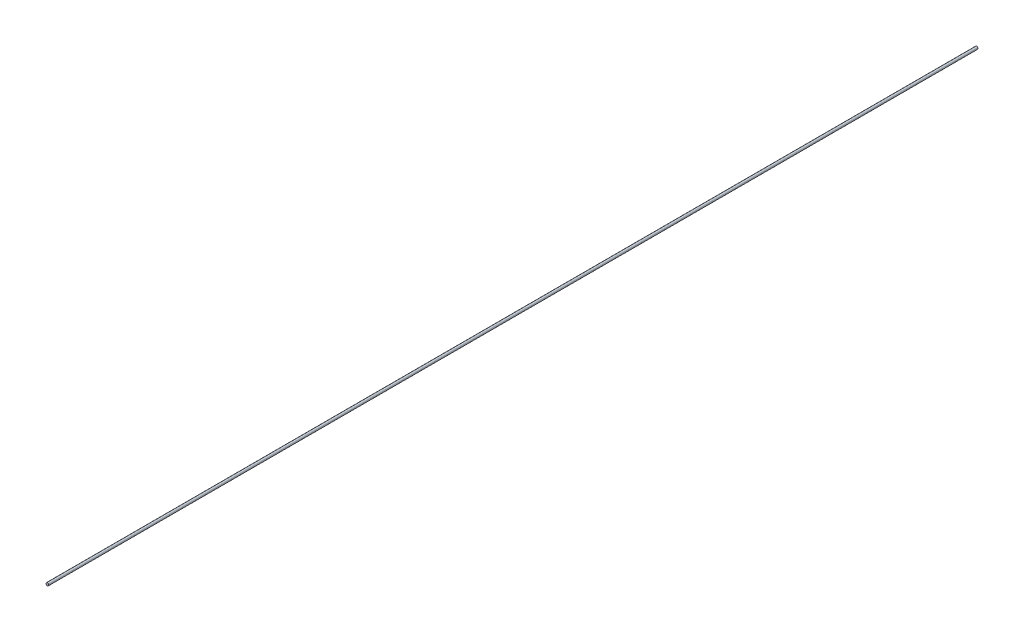
ISO-10303-21;
HEADER;
FILE_DESCRIPTION(('STEP AP214'),'2;1');
FILE_NAME('part.step','',(''),(''),'','','');
FILE_SCHEMA(('AUTOMOTIVE_DESIGN { 1 0 10303 214 1 1 1 1 }'));
ENDSEC;
DATA;
#1=APPLICATION_CONTEXT('core data for automotive mechanical design processes');
#2=APPLICATION_PROTOCOL_DEFINITION('international standard','automotive_design',2000,#1);
#3=PRODUCT_CONTEXT('',#1,'mechanical');
#4=PRODUCT('Part','Part','',(#3));
#5=PRODUCT_RELATED_PRODUCT_CATEGORY('part','',(#4));
#6=PRODUCT_DEFINITION_FORMATION('','',#4);
#7=PRODUCT_DEFINITION_CONTEXT('part definition',#1,'design');
#8=PRODUCT_DEFINITION('design','',#6,#7);
#9=PRODUCT_DEFINITION_SHAPE('','',#8);
#10=(LENGTH_UNIT() NAMED_UNIT(*) SI_UNIT(.MILLI.,.METRE.));
#11=(NAMED_UNIT(*) PLANE_ANGLE_UNIT() SI_UNIT($,.RADIAN.));
#12=(NAMED_UNIT(*) SI_UNIT($,.STERADIAN.) SOLID_ANGLE_UNIT());
#13=UNCERTAINTY_MEASURE_WITH_UNIT(LENGTH_MEASURE(1.E-05),#10,'distance_accuracy_value','');
#14=(GEOMETRIC_REPRESENTATION_CONTEXT(3) GLOBAL_UNCERTAINTY_ASSIGNED_CONTEXT((#13)) GLOBAL_UNIT_ASSIGNED_CONTEXT((#10,
#11,#12)) REPRESENTATION_CONTEXT('',''));
#15=CARTESIAN_POINT('',(0.,0.,0.));
#16=DIRECTION('',(0.,0.,1.));
#17=DIRECTION('',(1.,0.,0.));
#18=AXIS2_PLACEMENT_3D('',#15,#16,#17);
#19=CARTESIAN_POINT('',(0.,0.,700.));
#20=DIRECTION('',(0.,0.,-1.));
#21=DIRECTION('',(-1.,0.,0.));
#22=AXIS2_PLACEMENT_3D('',#19,#20,#21);
#23=CYLINDRICAL_SURFACE('',#22,1.);
#24=CARTESIAN_POINT('',(0.,0.,700.));
#25=DIRECTION('',(0.,0.,1.));
#26=DIRECTION('',(1.,0.,0.));
#27=AXIS2_PLACEMENT_3D('',#24,#25,#26);
#28=CIRCLE('',#27,1.);
#29=CARTESIAN_POINT('',(1.,0.,700.));
#30=VERTEX_POINT('',#29);
#31=EDGE_CURVE('E10',#30,#30,#28,.T.);
#32=ORIENTED_EDGE('',*,*,#31,.F.);
#33=EDGE_LOOP('',(#32));
#34=FACE_BOUND('',#33,.T.);
#35=CARTESIAN_POINT('',(0.,0.,0.));
#36=DIRECTION('',(0.,0.,1.));
#37=DIRECTION('',(1.,0.,0.));
#38=AXIS2_PLACEMENT_3D('',#35,#36,#37);
#39=CIRCLE('',#38,1.);
#40=CARTESIAN_POINT('',(1.,0.,0.));
#41=VERTEX_POINT('',#40);
#42=EDGE_CURVE('E34',#41,#41,#39,.T.);
#43=ORIENTED_EDGE('',*,*,#42,.T.);
#44=EDGE_LOOP('',(#43));
#45=FACE_BOUND('',#44,.T.);
#46=ADVANCED_FACE('F31',(#34,#45),#23,.T.);
#47=CARTESIAN_POINT('',(0.,0.,700.));
#48=DIRECTION('',(0.,0.,1.));
#49=DIRECTION('',(1.,0.,0.));
#50=AXIS2_PLACEMENT_3D('',#47,#48,#49);
#51=PLANE('',#50);
#52=ORIENTED_EDGE('',*,*,#31,.T.);
#53=EDGE_LOOP('',(#52));
#54=FACE_BOUND('',#53,.T.);
#55=ADVANCED_FACE('F46',(#54),#51,.T.);
#56=CARTESIAN_POINT('',(0.,0.,0.));
#57=DIRECTION('',(0.,0.,1.));
#58=DIRECTION('',(1.,0.,0.));
#59=AXIS2_PLACEMENT_3D('',#56,#57,#58);
#60=PLANE('',#59);
#61=ORIENTED_EDGE('',*,*,#42,.F.);
#62=EDGE_LOOP('',(#61));
#63=FACE_BOUND('',#62,.T.);
#64=ADVANCED_FACE('F44',(#63),#60,.F.);
#65=CLOSED_SHELL('',(#46,#55,#64));
#66=MANIFOLD_SOLID_BREP('B2',#65);
#67=ADVANCED_BREP_SHAPE_REPRESENTATION('',(#18,#66),#14);
#68=SHAPE_DEFINITION_REPRESENTATION(#9,#67);
ENDSEC;
END-ISO-10303-21;
